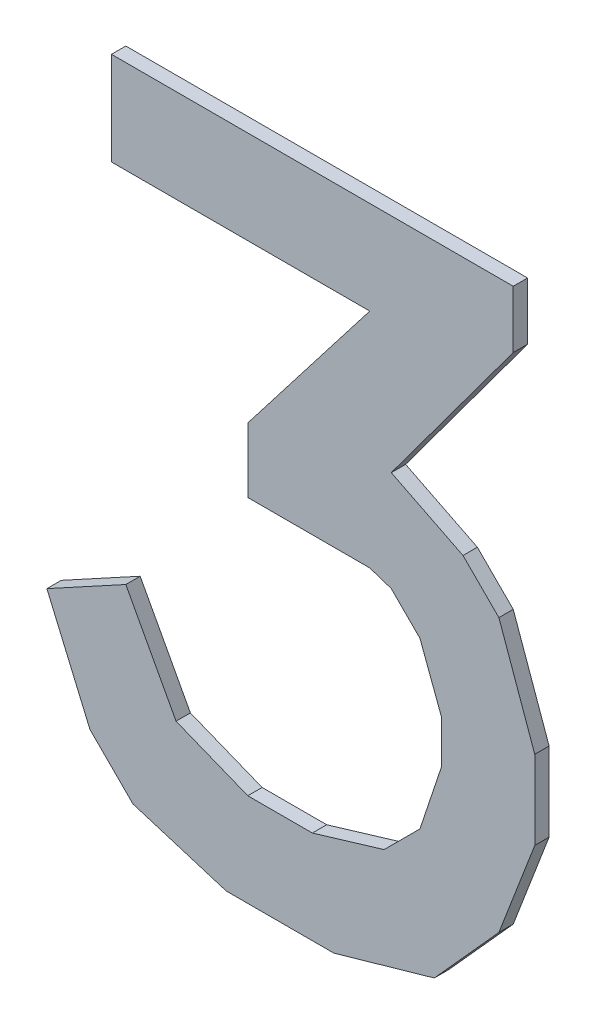
ISO-10303-21;
HEADER;
FILE_DESCRIPTION(('STEP AP214'),'2;1');
FILE_NAME('part.step','',(''),(''),'','','');
FILE_SCHEMA(('AUTOMOTIVE_DESIGN { 1 0 10303 214 1 1 1 1 }'));
ENDSEC;
DATA;
#1=APPLICATION_CONTEXT('core data for automotive mechanical design processes');
#2=APPLICATION_PROTOCOL_DEFINITION('international standard','automotive_design',2000,#1);
#3=PRODUCT_CONTEXT('',#1,'mechanical');
#4=PRODUCT('Part','Part','',(#3));
#5=PRODUCT_RELATED_PRODUCT_CATEGORY('part','',(#4));
#6=PRODUCT_DEFINITION_FORMATION('','',#4);
#7=PRODUCT_DEFINITION_CONTEXT('part definition',#1,'design');
#8=PRODUCT_DEFINITION('design','',#6,#7);
#9=PRODUCT_DEFINITION_SHAPE('','',#8);
#10=(LENGTH_UNIT() NAMED_UNIT(*) SI_UNIT(.MILLI.,.METRE.));
#11=(NAMED_UNIT(*) PLANE_ANGLE_UNIT() SI_UNIT($,.RADIAN.));
#12=(NAMED_UNIT(*) SI_UNIT($,.STERADIAN.) SOLID_ANGLE_UNIT());
#13=UNCERTAINTY_MEASURE_WITH_UNIT(LENGTH_MEASURE(1.E-05),#10,'distance_accuracy_value','');
#14=(GEOMETRIC_REPRESENTATION_CONTEXT(3) GLOBAL_UNCERTAINTY_ASSIGNED_CONTEXT((#13)) GLOBAL_UNIT_ASSIGNED_CONTEXT((#10,
#11,#12)) REPRESENTATION_CONTEXT('',''));
#15=CARTESIAN_POINT('',(0.,0.,0.));
#16=DIRECTION('',(0.,0.,1.));
#17=DIRECTION('',(1.,0.,0.));
#18=AXIS2_PLACEMENT_3D('',#15,#16,#17);
#19=CARTESIAN_POINT('',(-0.2499995,0.46500034,0.));
#20=DIRECTION('',(0.,0.,1.));
#21=DIRECTION('',(1.,0.,0.));
#22=AXIS2_PLACEMENT_3D('',#19,#20,#21);
#23=PLANE('',#22);
#24=DIRECTION('',(0.,1.,0.));
#25=VECTOR('',#24,1.);
#26=CARTESIAN_POINT('',(0.31000192,0.46500034,0.));
#27=LINE('',#26,#25);
#28=CARTESIAN_POINT('',(0.31000192,0.3850005,0.));
#29=VERTEX_POINT('',#28);
#30=CARTESIAN_POINT('',(0.31000192,0.46500034,0.));
#31=VERTEX_POINT('',#30);
#32=EDGE_CURVE('E42',#29,#31,#27,.T.);
#33=ORIENTED_EDGE('',*,*,#32,.F.);
#34=DIRECTION('',(0.594396804322224,0.804171896432304,0.));
#35=VECTOR('',#34,1.);
#36=CARTESIAN_POINT('',(0.13999972,0.15500096,0.));
#37=LINE('',#36,#35);
#38=CARTESIAN_POINT('',(0.13999972,0.15500096,0.));
#39=VERTEX_POINT('',#38);
#40=EDGE_CURVE('E308',#39,#29,#37,.T.);
#41=ORIENTED_EDGE('',*,*,#40,.F.);
#42=DIRECTION('',(-0.894427190999916,0.447213595499958,0.));
#43=VECTOR('',#42,1.);
#44=CARTESIAN_POINT('',(0.23999952,0.10500106,0.));
#45=LINE('',#44,#43);
#46=CARTESIAN_POINT('',(0.23999952,0.10500106,0.));
#47=VERTEX_POINT('',#46);
#48=EDGE_CURVE('E624',#47,#39,#45,.T.);
#49=ORIENTED_EDGE('',*,*,#48,.F.);
#50=DIRECTION('',(-0.707106781186548,0.707106781186548,0.));
#51=VECTOR('',#50,1.);
#52=CARTESIAN_POINT('',(0.28999942,0.05500116,0.));
#53=LINE('',#52,#51);
#54=CARTESIAN_POINT('',(0.28999942,0.05500116000001,0.));
#55=VERTEX_POINT('',#54);
#56=EDGE_CURVE('E361',#55,#47,#53,.T.);
#57=ORIENTED_EDGE('',*,*,#56,.F.);
#58=DIRECTION('',(-0.336351549994047,0.941736499673132,0.));
#59=VECTOR('',#58,1.);
#60=CARTESIAN_POINT('',(0.34000186,-0.08499856,0.));
#61=LINE('',#60,#59);
#62=CARTESIAN_POINT('',(0.34000186,-0.08499856,0.));
#63=VERTEX_POINT('',#62);
#64=EDGE_CURVE('E362',#63,#55,#61,.T.);
#65=ORIENTED_EDGE('',*,*,#64,.F.);
#66=DIRECTION('',(0.,1.,0.));
#67=VECTOR('',#66,1.);
#68=CARTESIAN_POINT('',(0.34000186,0.46500034,0.));
#69=LINE('',#68,#67);
#70=CARTESIAN_POINT('',(0.34000186,-0.19499834,0.));
#71=VERTEX_POINT('',#70);
#72=EDGE_CURVE('E417',#71,#63,#69,.T.);
#73=ORIENTED_EDGE('',*,*,#72,.F.);
#74=DIRECTION('',(0.358994965303913,0.933339496049772,0.));
#75=VECTOR('',#74,1.);
#76=CARTESIAN_POINT('',(0.28999942,-0.32499808,0.));
#77=LINE('',#76,#75);
#78=CARTESIAN_POINT('',(0.28999942,-0.32499808,0.));
#79=VERTEX_POINT('',#78);
#80=EDGE_CURVE('E312',#79,#71,#77,.T.);
#81=ORIENTED_EDGE('',*,*,#80,.F.);
#82=DIRECTION('',(0.668964731622284,0.743294146247316,0.));
#83=VECTOR('',#82,1.);
#84=CARTESIAN_POINT('',(0.1999996,-0.42499788,0.));
#85=LINE('',#84,#83);
#86=CARTESIAN_POINT('',(0.1999996,-0.42499788,0.));
#87=VERTEX_POINT('',#86);
#88=EDGE_CURVE('E367',#87,#79,#85,.T.);
#89=ORIENTED_EDGE('',*,*,#88,.F.);
#90=DIRECTION('',(0.961523947640936,0.274721127896982,0.));
#91=VECTOR('',#90,1.);
#92=CARTESIAN_POINT('',(0.05999987999999,-0.4649978,0.));
#93=LINE('',#92,#91);
#94=CARTESIAN_POINT('',(0.05999987999999,-0.4649978,0.));
#95=VERTEX_POINT('',#94);
#96=EDGE_CURVE('E368',#95,#87,#93,.T.);
#97=ORIENTED_EDGE('',*,*,#96,.F.);
#98=DIRECTION('',(1.,0.,0.));
#99=VECTOR('',#98,1.);
#100=CARTESIAN_POINT('',(-0.2499995,-0.4649978,0.));
#101=LINE('',#100,#99);
#102=CARTESIAN_POINT('',(-0.08999982,-0.4649978,0.));
#103=VERTEX_POINT('',#102);
#104=EDGE_CURVE('E444',#103,#95,#101,.T.);
#105=ORIENTED_EDGE('',*,*,#104,.F.);
#106=DIRECTION('',(0.95577900872182,-0.294085848837945,0.));
#107=VECTOR('',#106,1.);
#108=CARTESIAN_POINT('',(-0.21999956,-0.42499788,0.));
#109=LINE('',#108,#107);
#110=CARTESIAN_POINT('',(-0.21999956,-0.42499788,0.));
#111=VERTEX_POINT('',#110);
#112=EDGE_CURVE('E369',#111,#103,#109,.T.);
#113=ORIENTED_EDGE('',*,*,#112,.F.);
#114=DIRECTION('',(0.707106781186548,-0.707106781186548,0.));
#115=VECTOR('',#114,1.);
#116=CARTESIAN_POINT('',(-0.27999944,-0.364998,0.));
#117=LINE('',#116,#115);
#118=CARTESIAN_POINT('',(-0.27999944,-0.364998,0.));
#119=VERTEX_POINT('',#118);
#120=EDGE_CURVE('E318',#119,#111,#117,.T.);
#121=ORIENTED_EDGE('',*,*,#120,.F.);
#122=DIRECTION('',(0.393919298579047,-0.91914503001811,0.));
#123=VECTOR('',#122,1.);
#124=CARTESIAN_POINT('',(-0.33999932,-0.22499828,0.));
#125=LINE('',#124,#123);
#126=CARTESIAN_POINT('',(-0.33999932,-0.22499828,0.));
#127=VERTEX_POINT('',#126);
#128=EDGE_CURVE('E387',#127,#119,#125,.T.);
#129=ORIENTED_EDGE('',*,*,#128,.F.);
#130=DIRECTION('',(-0.877895572914117,-0.478852130681064,0.));
#131=VECTOR('',#130,1.);
#132=CARTESIAN_POINT('',(-0.22999954,-0.1649984,0.));
#133=LINE('',#132,#131);
#134=CARTESIAN_POINT('',(-0.22999954,-0.1649984,0.));
#135=VERTEX_POINT('',#134);
#136=EDGE_CURVE('E592',#135,#127,#133,.T.);
#137=ORIENTED_EDGE('',*,*,#136,.F.);
#138=DIRECTION('',(-0.474099823035077,0.880471099922143,0.));
#139=VECTOR('',#138,1.);
#140=CARTESIAN_POINT('',(-0.15999968,-0.29499814,0.));
#141=LINE('',#140,#139);
#142=CARTESIAN_POINT('',(-0.15999968,-0.29499814,0.));
#143=VERTEX_POINT('',#142);
#144=EDGE_CURVE('E482',#143,#135,#141,.T.);
#145=ORIENTED_EDGE('',*,*,#144,.F.);
#146=DIRECTION('',(-0.928476690885259,0.371390676354104,0.));
#147=VECTOR('',#146,1.);
#148=CARTESIAN_POINT('',(-0.05999988000001,-0.33499806,0.));
#149=LINE('',#148,#147);
#150=CARTESIAN_POINT('',(-0.05999988000001,-0.33499806,0.));
#151=VERTEX_POINT('',#150);
#152=EDGE_CURVE('E425',#151,#143,#149,.T.);
#153=ORIENTED_EDGE('',*,*,#152,.F.);
#154=DIRECTION('',(-1.,0.,0.));
#155=VECTOR('',#154,1.);
#156=CARTESIAN_POINT('',(-0.2499995,-0.33499806,0.));
#157=LINE('',#156,#155);
#158=CARTESIAN_POINT('',(0.02999994,-0.33499806,0.));
#159=VERTEX_POINT('',#158);
#160=EDGE_CURVE('E405',#159,#151,#157,.T.);
#161=ORIENTED_EDGE('',*,*,#160,.F.);
#162=DIRECTION('',(-0.957826285221234,-0.28734788556607,0.));
#163=VECTOR('',#162,1.);
#164=CARTESIAN_POINT('',(0.12999974,-0.30499812,0.));
#165=LINE('',#164,#163);
#166=CARTESIAN_POINT('',(0.12999974,-0.30499812,0.));
#167=VERTEX_POINT('',#166);
#168=EDGE_CURVE('E406',#167,#159,#165,.T.);
#169=ORIENTED_EDGE('',*,*,#168,.F.);
#170=DIRECTION('',(-0.707106781186548,-0.707106781186548,0.));
#171=VECTOR('',#170,1.);
#172=CARTESIAN_POINT('',(0.17999964,-0.25499822,0.));
#173=LINE('',#172,#171);
#174=CARTESIAN_POINT('',(0.17999964,-0.25499822,0.));
#175=VERTEX_POINT('',#174);
#176=EDGE_CURVE('E492',#175,#167,#173,.T.);
#177=ORIENTED_EDGE('',*,*,#176,.F.);
#178=DIRECTION('',(-0.316227766016838,-0.948683298050514,0.));
#179=VECTOR('',#178,1.);
#180=CARTESIAN_POINT('',(0.20999958,-0.1649984,0.));
#181=LINE('',#180,#179);
#182=CARTESIAN_POINT('',(0.20999958,-0.1649984,0.));
#183=VERTEX_POINT('',#182);
#184=EDGE_CURVE('E392',#183,#175,#181,.T.);
#185=ORIENTED_EDGE('',*,*,#184,.F.);
#186=DIRECTION('',(0.,-1.,0.));
#187=VECTOR('',#186,1.);
#188=CARTESIAN_POINT('',(0.20999958,0.46500034,0.));
#189=LINE('',#188,#187);
#190=CARTESIAN_POINT('',(0.20999958,-0.10499852,0.));
#191=VERTEX_POINT('',#190);
#192=EDGE_CURVE('E570',#191,#183,#189,.T.);
#193=ORIENTED_EDGE('',*,*,#192,.F.);
#194=DIRECTION('',(0.351123441588063,-0.936329177569168,0.));
#195=VECTOR('',#194,1.);
#196=CARTESIAN_POINT('',(0.17999964,-0.02499868,0.));
#197=LINE('',#196,#195);
#198=CARTESIAN_POINT('',(0.17999964,-0.02499868,0.));
#199=VERTEX_POINT('',#198);
#200=EDGE_CURVE('E556',#199,#191,#197,.T.);
#201=ORIENTED_EDGE('',*,*,#200,.F.);
#202=DIRECTION('',(0.707106781186548,-0.707106781186548,0.));
#203=VECTOR('',#202,1.);
#204=CARTESIAN_POINT('',(0.13999972,0.01500124,0.));
#205=LINE('',#204,#203);
#206=CARTESIAN_POINT('',(0.13999972,0.01500124,0.));
#207=VERTEX_POINT('',#206);
#208=EDGE_CURVE('E529',#207,#199,#205,.T.);
#209=ORIENTED_EDGE('',*,*,#208,.F.);
#210=DIRECTION('',(0.948683298050514,-0.316227766016838,0.));
#211=VECTOR('',#210,1.);
#212=CARTESIAN_POINT('',(0.10999978,0.02500121999999,0.));
#213=LINE('',#212,#211);
#214=CARTESIAN_POINT('',(0.10999978,0.02500121999999,0.));
#215=VERTEX_POINT('',#214);
#216=EDGE_CURVE('E530',#215,#207,#213,.T.);
#217=ORIENTED_EDGE('',*,*,#216,.F.);
#218=DIRECTION('',(1.,0.,0.));
#219=VECTOR('',#218,1.);
#220=CARTESIAN_POINT('',(-0.2499995,0.02500121999999,0.));
#221=LINE('',#220,#219);
#222=CARTESIAN_POINT('',(-0.05999988000001,0.02500121999999,0.));
#223=VERTEX_POINT('',#222);
#224=EDGE_CURVE('E538',#223,#215,#221,.T.);
#225=ORIENTED_EDGE('',*,*,#224,.F.);
#226=DIRECTION('',(0.,-1.,0.));
#227=VECTOR('',#226,1.);
#228=CARTESIAN_POINT('',(-0.05999988000001,0.46500034,0.));
#229=LINE('',#228,#227);
#230=CARTESIAN_POINT('',(-0.05999988000001,0.11500104,0.));
#231=VERTEX_POINT('',#230);
#232=EDGE_CURVE('E524',#231,#223,#229,.T.);
#233=ORIENTED_EDGE('',*,*,#232,.F.);
#234=DIRECTION('',(-0.611447501075993,-0.791285001391991,0.));
#235=VECTOR('',#234,1.);
#236=CARTESIAN_POINT('',(0.10999978,0.3350006,0.));
#237=LINE('',#236,#235);
#238=CARTESIAN_POINT('',(0.10999978,0.3350006,0.));
#239=VERTEX_POINT('',#238);
#240=EDGE_CURVE('E469',#239,#231,#237,.T.);
#241=ORIENTED_EDGE('',*,*,#240,.F.);
#242=DIRECTION('',(1.,0.,0.));
#243=VECTOR('',#242,1.);
#244=CARTESIAN_POINT('',(-0.2499995,0.3350006,0.));
#245=LINE('',#244,#243);
#246=CARTESIAN_POINT('',(-0.2499995,0.3350006,0.));
#247=VERTEX_POINT('',#246);
#248=EDGE_CURVE('E470',#247,#239,#245,.T.);
#249=ORIENTED_EDGE('',*,*,#248,.F.);
#250=DIRECTION('',(0.,-1.,0.));
#251=VECTOR('',#250,1.);
#252=CARTESIAN_POINT('',(-0.2499995,0.46500034,0.));
#253=LINE('',#252,#251);
#254=CARTESIAN_POINT('',(-0.2499995,0.46500034,0.));
#255=VERTEX_POINT('',#254);
#256=EDGE_CURVE('E374',#255,#247,#253,.T.);
#257=ORIENTED_EDGE('',*,*,#256,.F.);
#258=DIRECTION('',(-1.,0.,0.));
#259=VECTOR('',#258,1.);
#260=CARTESIAN_POINT('',(-0.2499995,0.46500034,0.));
#261=LINE('',#260,#259);
#262=EDGE_CURVE('E11',#31,#255,#261,.T.);
#263=ORIENTED_EDGE('',*,*,#262,.F.);
#264=EDGE_LOOP('',(#33,#41,#49,#57,#65,#73,#81,#89,#97,#105,#113,#121,#129,#137,#145,#153,#161,
#169,#177,#185,#193,#201,#209,#217,#225,#233,#241,#249,#257,#263));
#265=FACE_BOUND('',#264,.T.);
#266=ADVANCED_FACE('F17',(#265),#23,.F.);
#267=CARTESIAN_POINT('',(-0.2499995,0.46500034,0.));
#268=DIRECTION('',(0.,1.,0.));
#269=DIRECTION('',(1.,0.,0.));
#270=AXIS2_PLACEMENT_3D('',#267,#268,#269);
#271=PLANE('',#270);
#272=DIRECTION('',(0.,0.,-1.));
#273=VECTOR('',#272,1.);
#274=CARTESIAN_POINT('',(0.31000192,0.46500034,0.));
#275=LINE('',#274,#273);
#276=CARTESIAN_POINT('',(0.31000192,0.46500034,0.02));
#277=VERTEX_POINT('',#276);
#278=EDGE_CURVE('E25',#277,#31,#275,.T.);
#279=ORIENTED_EDGE('',*,*,#278,.T.);
#280=ORIENTED_EDGE('',*,*,#262,.T.);
#281=DIRECTION('',(0.,0.,1.));
#282=VECTOR('',#281,1.);
#283=CARTESIAN_POINT('',(-0.2499995,0.46500034,0.));
#284=LINE('',#283,#282);
#285=CARTESIAN_POINT('',(-0.2499995,0.46500034,0.02));
#286=VERTEX_POINT('',#285);
#287=EDGE_CURVE('E286',#255,#286,#284,.T.);
#288=ORIENTED_EDGE('',*,*,#287,.T.);
#289=DIRECTION('',(1.,0.,0.));
#290=VECTOR('',#289,1.);
#291=CARTESIAN_POINT('',(-0.2499995,0.46500034,0.02));
#292=LINE('',#291,#290);
#293=EDGE_CURVE('E283',#286,#277,#292,.T.);
#294=ORIENTED_EDGE('',*,*,#293,.T.);
#295=EDGE_LOOP('',(#279,#280,#288,#294));
#296=FACE_BOUND('',#295,.T.);
#297=ADVANCED_FACE('F284',(#296),#271,.T.);
#298=CARTESIAN_POINT('',(0.31000192,0.46500034,0.));
#299=DIRECTION('',(1.,0.,0.));
#300=DIRECTION('',(0.,1.,0.));
#301=AXIS2_PLACEMENT_3D('',#298,#299,#300);
#302=PLANE('',#301);
#303=DIRECTION('',(0.,0.,-1.));
#304=VECTOR('',#303,1.);
#305=CARTESIAN_POINT('',(0.31000192,0.3850005,0.));
#306=LINE('',#305,#304);
#307=CARTESIAN_POINT('',(0.31000192,0.3850005,0.02));
#308=VERTEX_POINT('',#307);
#309=EDGE_CURVE('E305',#308,#29,#306,.T.);
#310=ORIENTED_EDGE('',*,*,#309,.T.);
#311=ORIENTED_EDGE('',*,*,#32,.T.);
#312=ORIENTED_EDGE('',*,*,#278,.F.);
#313=DIRECTION('',(0.,-1.,0.));
#314=VECTOR('',#313,1.);
#315=CARTESIAN_POINT('',(0.31000192,0.46500034,0.02));
#316=LINE('',#315,#314);
#317=EDGE_CURVE('E279',#277,#308,#316,.T.);
#318=ORIENTED_EDGE('',*,*,#317,.T.);
#319=EDGE_LOOP('',(#310,#311,#312,#318));
#320=FACE_BOUND('',#319,.T.);
#321=ADVANCED_FACE('F277',(#320),#302,.T.);
#322=CARTESIAN_POINT('',(0.31000192,0.3850005,0.));
#323=DIRECTION('',(0.804171896432304,-0.594396804322224,0.));
#324=DIRECTION('',(0.,0.,-1.));
#325=AXIS2_PLACEMENT_3D('',#322,#323,#324);
#326=PLANE('',#325);
#327=DIRECTION('',(0.,0.,-1.));
#328=VECTOR('',#327,1.);
#329=CARTESIAN_POINT('',(0.13999972,0.15500096,0.));
#330=LINE('',#329,#328);
#331=CARTESIAN_POINT('',(0.13999972,0.15500096,0.02));
#332=VERTEX_POINT('',#331);
#333=EDGE_CURVE('E628',#332,#39,#330,.T.);
#334=ORIENTED_EDGE('',*,*,#333,.T.);
#335=ORIENTED_EDGE('',*,*,#40,.T.);
#336=ORIENTED_EDGE('',*,*,#309,.F.);
#337=DIRECTION('',(-0.594396804322224,-0.804171896432304,0.));
#338=VECTOR('',#337,1.);
#339=CARTESIAN_POINT('',(0.31000192,0.3850005,0.02));
#340=LINE('',#339,#338);
#341=EDGE_CURVE('E297',#308,#332,#340,.T.);
#342=ORIENTED_EDGE('',*,*,#341,.T.);
#343=EDGE_LOOP('',(#334,#335,#336,#342));
#344=FACE_BOUND('',#343,.T.);
#345=ADVANCED_FACE('F943',(#344),#326,.T.);
#346=CARTESIAN_POINT('',(0.13999972,0.15500096,0.));
#347=DIRECTION('',(0.447213595499958,0.894427190999916,0.));
#348=DIRECTION('',(0.,0.,-1.));
#349=AXIS2_PLACEMENT_3D('',#346,#347,#348);
#350=PLANE('',#349);
#351=DIRECTION('',(0.,0.,-1.));
#352=VECTOR('',#351,1.);
#353=CARTESIAN_POINT('',(0.23999952,0.10500106,0.));
#354=LINE('',#353,#352);
#355=CARTESIAN_POINT('',(0.23999952,0.10500106,0.02));
#356=VERTEX_POINT('',#355);
#357=EDGE_CURVE('E620',#356,#47,#354,.T.);
#358=ORIENTED_EDGE('',*,*,#357,.T.);
#359=ORIENTED_EDGE('',*,*,#48,.T.);
#360=ORIENTED_EDGE('',*,*,#333,.F.);
#361=DIRECTION('',(0.894427190999916,-0.447213595499958,0.));
#362=VECTOR('',#361,1.);
#363=CARTESIAN_POINT('',(0.13999972,0.15500096,0.02));
#364=LINE('',#363,#362);
#365=EDGE_CURVE('E338',#332,#356,#364,.T.);
#366=ORIENTED_EDGE('',*,*,#365,.T.);
#367=EDGE_LOOP('',(#358,#359,#360,#366));
#368=FACE_BOUND('',#367,.T.);
#369=ADVANCED_FACE('F941',(#368),#350,.T.);
#370=CARTESIAN_POINT('',(0.23999952,0.10500106,0.));
#371=DIRECTION('',(0.707106781186048,0.707106781187048,0.));
#372=DIRECTION('',(0.,0.,-1.));
#373=AXIS2_PLACEMENT_3D('',#370,#371,#372);
#374=PLANE('',#373);
#375=DIRECTION('',(0.,0.,-1.));
#376=VECTOR('',#375,1.);
#377=CARTESIAN_POINT('',(0.28999942,0.05500116000004,0.));
#378=LINE('',#377,#376);
#379=CARTESIAN_POINT('',(0.28999942,0.05500116000001,0.02));
#380=VERTEX_POINT('',#379);
#381=EDGE_CURVE('E357',#380,#55,#378,.T.);
#382=ORIENTED_EDGE('',*,*,#381,.T.);
#383=ORIENTED_EDGE('',*,*,#56,.T.);
#384=ORIENTED_EDGE('',*,*,#357,.F.);
#385=DIRECTION('',(0.707106781187048,-0.707106781186048,0.));
#386=VECTOR('',#385,1.);
#387=CARTESIAN_POINT('',(0.23999952,0.10500106,0.02));
#388=LINE('',#387,#386);
#389=EDGE_CURVE('E342',#356,#380,#388,.T.);
#390=ORIENTED_EDGE('',*,*,#389,.T.);
#391=EDGE_LOOP('',(#382,#383,#384,#390));
#392=FACE_BOUND('',#391,.T.);
#393=ADVANCED_FACE('F939',(#392),#374,.T.);
#394=CARTESIAN_POINT('',(0.28999942,0.05500116,0.));
#395=DIRECTION('',(0.941736499673132,0.336351549994047,0.));
#396=DIRECTION('',(0.,0.,-1.));
#397=AXIS2_PLACEMENT_3D('',#394,#395,#396);
#398=PLANE('',#397);
#399=DIRECTION('',(0.,0.,-1.));
#400=VECTOR('',#399,1.);
#401=CARTESIAN_POINT('',(0.34000186,-0.08499855999999,0.));
#402=LINE('',#401,#400);
#403=CARTESIAN_POINT('',(0.34000186,-0.08499856,0.02));
#404=VERTEX_POINT('',#403);
#405=EDGE_CURVE('E413',#404,#63,#402,.T.);
#406=ORIENTED_EDGE('',*,*,#405,.T.);
#407=ORIENTED_EDGE('',*,*,#64,.T.);
#408=ORIENTED_EDGE('',*,*,#381,.F.);
#409=DIRECTION('',(0.336351549994047,-0.941736499673132,0.));
#410=VECTOR('',#409,1.);
#411=CARTESIAN_POINT('',(0.28999942,0.05500116,0.02));
#412=LINE('',#411,#410);
#413=EDGE_CURVE('E491',#380,#404,#412,.T.);
#414=ORIENTED_EDGE('',*,*,#413,.T.);
#415=EDGE_LOOP('',(#406,#407,#408,#414));
#416=FACE_BOUND('',#415,.T.);
#417=ADVANCED_FACE('F937',(#416),#398,.T.);
#418=CARTESIAN_POINT('',(0.34000186,-0.08499856,0.));
#419=DIRECTION('',(1.,0.,0.));
#420=DIRECTION('',(0.,1.,0.));
#421=AXIS2_PLACEMENT_3D('',#418,#419,#420);
#422=PLANE('',#421);
#423=DIRECTION('',(0.,0.,-1.));
#424=VECTOR('',#423,1.);
#425=CARTESIAN_POINT('',(0.34000186,-0.19499834,0.));
#426=LINE('',#425,#424);
#427=CARTESIAN_POINT('',(0.34000186,-0.19499834,0.02));
#428=VERTEX_POINT('',#427);
#429=EDGE_CURVE('E316',#428,#71,#426,.T.);
#430=ORIENTED_EDGE('',*,*,#429,.T.);
#431=ORIENTED_EDGE('',*,*,#72,.T.);
#432=ORIENTED_EDGE('',*,*,#405,.F.);
#433=DIRECTION('',(0.,-1.,0.));
#434=VECTOR('',#433,1.);
#435=CARTESIAN_POINT('',(0.34000186,-0.08499856,0.02));
#436=LINE('',#435,#434);
#437=EDGE_CURVE('E481',#404,#428,#436,.T.);
#438=ORIENTED_EDGE('',*,*,#437,.T.);
#439=EDGE_LOOP('',(#430,#431,#432,#438));
#440=FACE_BOUND('',#439,.T.);
#441=ADVANCED_FACE('F933',(#440),#422,.T.);
#442=CARTESIAN_POINT('',(0.34000186,-0.19499834,0.));
#443=DIRECTION('',(0.933339496049772,-0.358994965303913,0.));
#444=DIRECTION('',(0.,0.,-1.));
#445=AXIS2_PLACEMENT_3D('',#442,#443,#444);
#446=PLANE('',#445);
#447=DIRECTION('',(0.,0.,-1.));
#448=VECTOR('',#447,1.);
#449=CARTESIAN_POINT('',(0.28999942,-0.32499808,0.));
#450=LINE('',#449,#448);
#451=CARTESIAN_POINT('',(0.28999942,-0.32499808,0.02));
#452=VERTEX_POINT('',#451);
#453=EDGE_CURVE('E317',#452,#79,#450,.T.);
#454=ORIENTED_EDGE('',*,*,#453,.T.);
#455=ORIENTED_EDGE('',*,*,#80,.T.);
#456=ORIENTED_EDGE('',*,*,#429,.F.);
#457=DIRECTION('',(-0.358994965303913,-0.933339496049772,0.));
#458=VECTOR('',#457,1.);
#459=CARTESIAN_POINT('',(0.34000186,-0.19499834,0.02));
#460=LINE('',#459,#458);
#461=EDGE_CURVE('E474',#428,#452,#460,.T.);
#462=ORIENTED_EDGE('',*,*,#461,.T.);
#463=EDGE_LOOP('',(#454,#455,#456,#462));
#464=FACE_BOUND('',#463,.T.);
#465=ADVANCED_FACE('F931',(#464),#446,.T.);
#466=CARTESIAN_POINT('',(0.28999942,-0.32499808,0.));
#467=DIRECTION('',(0.743294146247316,-0.668964731622284,0.));
#468=DIRECTION('',(0.,0.,-1.));
#469=AXIS2_PLACEMENT_3D('',#466,#467,#468);
#470=PLANE('',#469);
#471=DIRECTION('',(0.,0.,-1.));
#472=VECTOR('',#471,1.);
#473=CARTESIAN_POINT('',(0.1999996,-0.42499788,0.));
#474=LINE('',#473,#472);
#475=CARTESIAN_POINT('',(0.1999996,-0.42499788,0.02));
#476=VERTEX_POINT('',#475);
#477=EDGE_CURVE('E363',#476,#87,#474,.T.);
#478=ORIENTED_EDGE('',*,*,#477,.T.);
#479=ORIENTED_EDGE('',*,*,#88,.T.);
#480=ORIENTED_EDGE('',*,*,#453,.F.);
#481=DIRECTION('',(-0.668964731622284,-0.743294146247316,0.));
#482=VECTOR('',#481,1.);
#483=CARTESIAN_POINT('',(0.28999942,-0.32499808,0.02));
#484=LINE('',#483,#482);
#485=EDGE_CURVE('E464',#452,#476,#484,.T.);
#486=ORIENTED_EDGE('',*,*,#485,.T.);
#487=EDGE_LOOP('',(#478,#479,#480,#486));
#488=FACE_BOUND('',#487,.T.);
#489=ADVANCED_FACE('F929',(#488),#470,.T.);
#490=CARTESIAN_POINT('',(0.1999996,-0.42499788,0.));
#491=DIRECTION('',(0.274721127896982,-0.961523947640936,0.));
#492=DIRECTION('',(0.,0.,-1.));
#493=AXIS2_PLACEMENT_3D('',#490,#491,#492);
#494=PLANE('',#493);
#495=DIRECTION('',(0.,0.,-1.));
#496=VECTOR('',#495,1.);
#497=CARTESIAN_POINT('',(0.05999987999997,-0.4649978,0.));
#498=LINE('',#497,#496);
#499=CARTESIAN_POINT('',(0.05999987999999,-0.4649978,0.02));
#500=VERTEX_POINT('',#499);
#501=EDGE_CURVE('E440',#500,#95,#498,.T.);
#502=ORIENTED_EDGE('',*,*,#501,.T.);
#503=ORIENTED_EDGE('',*,*,#96,.T.);
#504=ORIENTED_EDGE('',*,*,#477,.F.);
#505=DIRECTION('',(-0.961523947640936,-0.274721127896982,0.));
#506=VECTOR('',#505,1.);
#507=CARTESIAN_POINT('',(0.1999996,-0.42499788,0.02));
#508=LINE('',#507,#506);
#509=EDGE_CURVE('E460',#476,#500,#508,.T.);
#510=ORIENTED_EDGE('',*,*,#509,.T.);
#511=EDGE_LOOP('',(#502,#503,#504,#510));
#512=FACE_BOUND('',#511,.T.);
#513=ADVANCED_FACE('F924',(#512),#494,.T.);
#514=CARTESIAN_POINT('',(0.05999987999999,-0.4649978,0.));
#515=DIRECTION('',(0.,-1.,0.));
#516=DIRECTION('',(0.,0.,-1.));
#517=AXIS2_PLACEMENT_3D('',#514,#515,#516);
#518=PLANE('',#517);
#519=DIRECTION('',(0.,0.,-1.));
#520=VECTOR('',#519,1.);
#521=CARTESIAN_POINT('',(-0.08999982,-0.4649978,0.));
#522=LINE('',#521,#520);
#523=CARTESIAN_POINT('',(-0.08999982,-0.4649978,0.02));
#524=VERTEX_POINT('',#523);
#525=EDGE_CURVE('E373',#524,#103,#522,.T.);
#526=ORIENTED_EDGE('',*,*,#525,.T.);
#527=ORIENTED_EDGE('',*,*,#104,.T.);
#528=ORIENTED_EDGE('',*,*,#501,.F.);
#529=DIRECTION('',(-1.,0.,0.));
#530=VECTOR('',#529,1.);
#531=CARTESIAN_POINT('',(0.05999987999999,-0.4649978,0.02));
#532=LINE('',#531,#530);
#533=EDGE_CURVE('E456',#500,#524,#532,.T.);
#534=ORIENTED_EDGE('',*,*,#533,.T.);
#535=EDGE_LOOP('',(#526,#527,#528,#534));
#536=FACE_BOUND('',#535,.T.);
#537=ADVANCED_FACE('F922',(#536),#518,.T.);
#538=CARTESIAN_POINT('',(-0.08999982,-0.4649978,0.));
#539=DIRECTION('',(-0.294085848837945,-0.95577900872182,0.));
#540=DIRECTION('',(-0.95577900872182,0.294085848837945,0.));
#541=AXIS2_PLACEMENT_3D('',#538,#539,#540);
#542=PLANE('',#541);
#543=DIRECTION('',(0.,0.,-1.));
#544=VECTOR('',#543,1.);
#545=CARTESIAN_POINT('',(-0.21999956,-0.42499788,0.));
#546=LINE('',#545,#544);
#547=CARTESIAN_POINT('',(-0.21999956,-0.42499788,0.02));
#548=VERTEX_POINT('',#547);
#549=EDGE_CURVE('E322',#548,#111,#546,.T.);
#550=ORIENTED_EDGE('',*,*,#549,.T.);
#551=ORIENTED_EDGE('',*,*,#112,.T.);
#552=ORIENTED_EDGE('',*,*,#525,.F.);
#553=DIRECTION('',(-0.95577900872182,0.294085848837945,0.));
#554=VECTOR('',#553,1.);
#555=CARTESIAN_POINT('',(-0.08999982,-0.4649978,0.02));
#556=LINE('',#555,#554);
#557=EDGE_CURVE('E452',#524,#548,#556,.T.);
#558=ORIENTED_EDGE('',*,*,#557,.T.);
#559=EDGE_LOOP('',(#550,#551,#552,#558));
#560=FACE_BOUND('',#559,.T.);
#561=ADVANCED_FACE('F920',(#560),#542,.T.);
#562=CARTESIAN_POINT('',(-0.21999956,-0.42499788,0.));
#563=DIRECTION('',(-0.707106781187048,-0.707106781186048,0.));
#564=DIRECTION('',(-0.707106781186048,0.707106781187048,0.));
#565=AXIS2_PLACEMENT_3D('',#562,#563,#564);
#566=PLANE('',#565);
#567=DIRECTION('',(0.,0.,-1.));
#568=VECTOR('',#567,1.);
#569=CARTESIAN_POINT('',(-0.27999944,-0.364998,0.));
#570=LINE('',#569,#568);
#571=CARTESIAN_POINT('',(-0.27999944,-0.364998,0.02));
#572=VERTEX_POINT('',#571);
#573=EDGE_CURVE('E323',#572,#119,#570,.T.);
#574=ORIENTED_EDGE('',*,*,#573,.T.);
#575=ORIENTED_EDGE('',*,*,#120,.T.);
#576=ORIENTED_EDGE('',*,*,#549,.F.);
#577=DIRECTION('',(-0.707106781186048,0.707106781187048,0.));
#578=VECTOR('',#577,1.);
#579=CARTESIAN_POINT('',(-0.21999956,-0.42499788,0.02));
#580=LINE('',#579,#578);
#581=EDGE_CURVE('E448',#548,#572,#580,.T.);
#582=ORIENTED_EDGE('',*,*,#581,.T.);
#583=EDGE_LOOP('',(#574,#575,#576,#582));
#584=FACE_BOUND('',#583,.T.);
#585=ADVANCED_FACE('F915',(#584),#566,.T.);
#586=CARTESIAN_POINT('',(-0.27999944,-0.364998,0.));
#587=DIRECTION('',(-0.91914503001811,-0.393919298579047,0.));
#588=DIRECTION('',(-0.393919298579047,0.91914503001811,0.));
#589=AXIS2_PLACEMENT_3D('',#586,#587,#588);
#590=PLANE('',#589);
#591=DIRECTION('',(0.,0.,-1.));
#592=VECTOR('',#591,1.);
#593=CARTESIAN_POINT('',(-0.33999932,-0.22499828,0.));
#594=LINE('',#593,#592);
#595=CARTESIAN_POINT('',(-0.33999932,-0.22499828,0.02));
#596=VERTEX_POINT('',#595);
#597=EDGE_CURVE('E391',#596,#127,#594,.T.);
#598=ORIENTED_EDGE('',*,*,#597,.T.);
#599=ORIENTED_EDGE('',*,*,#128,.T.);
#600=ORIENTED_EDGE('',*,*,#573,.F.);
#601=DIRECTION('',(-0.393919298579047,0.91914503001811,0.));
#602=VECTOR('',#601,1.);
#603=CARTESIAN_POINT('',(-0.27999944,-0.364998,0.02));
#604=LINE('',#603,#602);
#605=EDGE_CURVE('E439',#572,#596,#604,.T.);
#606=ORIENTED_EDGE('',*,*,#605,.T.);
#607=EDGE_LOOP('',(#598,#599,#600,#606));
#608=FACE_BOUND('',#607,.T.);
#609=ADVANCED_FACE('F908',(#608),#590,.T.);
#610=CARTESIAN_POINT('',(-0.33999932,-0.22499828,0.));
#611=DIRECTION('',(-0.478852130681064,0.877895572914117,0.));
#612=DIRECTION('',(0.,0.,1.));
#613=AXIS2_PLACEMENT_3D('',#610,#611,#612);
#614=PLANE('',#613);
#615=DIRECTION('',(0.,0.,-1.));
#616=VECTOR('',#615,1.);
#617=CARTESIAN_POINT('',(-0.22999954,-0.1649984,0.));
#618=LINE('',#617,#616);
#619=CARTESIAN_POINT('',(-0.22999954,-0.1649984,0.02));
#620=VERTEX_POINT('',#619);
#621=EDGE_CURVE('E486',#620,#135,#618,.T.);
#622=ORIENTED_EDGE('',*,*,#621,.T.);
#623=ORIENTED_EDGE('',*,*,#136,.T.);
#624=ORIENTED_EDGE('',*,*,#597,.F.);
#625=DIRECTION('',(0.877895572914117,0.478852130681064,0.));
#626=VECTOR('',#625,1.);
#627=CARTESIAN_POINT('',(-0.33999932,-0.22499828,0.02));
#628=LINE('',#627,#626);
#629=EDGE_CURVE('E435',#596,#620,#628,.T.);
#630=ORIENTED_EDGE('',*,*,#629,.T.);
#631=EDGE_LOOP('',(#622,#623,#624,#630));
#632=FACE_BOUND('',#631,.T.);
#633=ADVANCED_FACE('F913',(#632),#614,.T.);
#634=CARTESIAN_POINT('',(-0.22999954,-0.1649984,0.));
#635=DIRECTION('',(0.880471099922143,0.474099823035077,0.));
#636=DIRECTION('',(0.,0.,-1.));
#637=AXIS2_PLACEMENT_3D('',#634,#635,#636);
#638=PLANE('',#637);
#639=DIRECTION('',(0.,0.,-1.));
#640=VECTOR('',#639,1.);
#641=CARTESIAN_POINT('',(-0.15999968,-0.29499814,0.));
#642=LINE('',#641,#640);
#643=CARTESIAN_POINT('',(-0.15999968,-0.29499814,0.02));
#644=VERTEX_POINT('',#643);
#645=EDGE_CURVE('E487',#644,#143,#642,.T.);
#646=ORIENTED_EDGE('',*,*,#645,.T.);
#647=ORIENTED_EDGE('',*,*,#144,.T.);
#648=ORIENTED_EDGE('',*,*,#621,.F.);
#649=DIRECTION('',(0.474099823035077,-0.880471099922143,0.));
#650=VECTOR('',#649,1.);
#651=CARTESIAN_POINT('',(-0.22999954,-0.1649984,0.02));
#652=LINE('',#651,#650);
#653=EDGE_CURVE('E411',#620,#644,#652,.T.);
#654=ORIENTED_EDGE('',*,*,#653,.T.);
#655=EDGE_LOOP('',(#646,#647,#648,#654));
#656=FACE_BOUND('',#655,.T.);
#657=ADVANCED_FACE('F1018',(#656),#638,.T.);
#658=CARTESIAN_POINT('',(-0.15999968,-0.29499814,0.));
#659=DIRECTION('',(0.371390676354104,0.928476690885259,0.));
#660=DIRECTION('',(0.,0.,-1.));
#661=AXIS2_PLACEMENT_3D('',#658,#659,#660);
#662=PLANE('',#661);
#663=DIRECTION('',(0.,0.,-1.));
#664=VECTOR('',#663,1.);
#665=CARTESIAN_POINT('',(-0.05999988000001,-0.33499806,0.));
#666=LINE('',#665,#664);
#667=CARTESIAN_POINT('',(-0.05999988000001,-0.33499806,0.02));
#668=VERTEX_POINT('',#667);
#669=EDGE_CURVE('E421',#668,#151,#666,.T.);
#670=ORIENTED_EDGE('',*,*,#669,.T.);
#671=ORIENTED_EDGE('',*,*,#152,.T.);
#672=ORIENTED_EDGE('',*,*,#645,.F.);
#673=DIRECTION('',(0.928476690885259,-0.371390676354104,0.));
#674=VECTOR('',#673,1.);
#675=CARTESIAN_POINT('',(-0.15999968,-0.29499814,0.02));
#676=LINE('',#675,#674);
#677=EDGE_CURVE('E407',#644,#668,#676,.T.);
#678=ORIENTED_EDGE('',*,*,#677,.T.);
#679=EDGE_LOOP('',(#670,#671,#672,#678));
#680=FACE_BOUND('',#679,.T.);
#681=ADVANCED_FACE('F1025',(#680),#662,.T.);
#682=CARTESIAN_POINT('',(-0.05999988000001,-0.33499806,0.));
#683=DIRECTION('',(0.,1.,0.));
#684=DIRECTION('',(1.,0.,0.));
#685=AXIS2_PLACEMENT_3D('',#682,#683,#684);
#686=PLANE('',#685);
#687=DIRECTION('',(0.,0.,-1.));
#688=VECTOR('',#687,1.);
#689=CARTESIAN_POINT('',(0.02999994,-0.33499806,0.));
#690=LINE('',#689,#688);
#691=CARTESIAN_POINT('',(0.02999994,-0.33499806,0.02));
#692=VERTEX_POINT('',#691);
#693=EDGE_CURVE('E401',#692,#159,#690,.T.);
#694=ORIENTED_EDGE('',*,*,#693,.T.);
#695=ORIENTED_EDGE('',*,*,#160,.T.);
#696=ORIENTED_EDGE('',*,*,#669,.F.);
#697=DIRECTION('',(1.,0.,0.));
#698=VECTOR('',#697,1.);
#699=CARTESIAN_POINT('',(-0.05999988000001,-0.33499806,0.02));
#700=LINE('',#699,#698);
#701=EDGE_CURVE('E412',#668,#692,#700,.T.);
#702=ORIENTED_EDGE('',*,*,#701,.T.);
#703=EDGE_LOOP('',(#694,#695,#696,#702));
#704=FACE_BOUND('',#703,.T.);
#705=ADVANCED_FACE('F1034',(#704),#686,.T.);
#706=CARTESIAN_POINT('',(0.02999994,-0.33499806,0.));
#707=DIRECTION('',(-0.28734788556607,0.957826285221234,0.));
#708=DIRECTION('',(0.,0.,1.));
#709=AXIS2_PLACEMENT_3D('',#706,#707,#708);
#710=PLANE('',#709);
#711=DIRECTION('',(0.,0.,-1.));
#712=VECTOR('',#711,1.);
#713=CARTESIAN_POINT('',(0.12999974,-0.30499812,0.));
#714=LINE('',#713,#712);
#715=CARTESIAN_POINT('',(0.12999974,-0.30499812,0.02));
#716=VERTEX_POINT('',#715);
#717=EDGE_CURVE('E496',#716,#167,#714,.T.);
#718=ORIENTED_EDGE('',*,*,#717,.T.);
#719=ORIENTED_EDGE('',*,*,#168,.T.);
#720=ORIENTED_EDGE('',*,*,#693,.F.);
#721=DIRECTION('',(0.957826285221234,0.28734788556607,0.));
#722=VECTOR('',#721,1.);
#723=CARTESIAN_POINT('',(0.02999994,-0.33499806,0.02));
#724=LINE('',#723,#722);
#725=EDGE_CURVE('E328',#692,#716,#724,.T.);
#726=ORIENTED_EDGE('',*,*,#725,.T.);
#727=EDGE_LOOP('',(#718,#719,#720,#726));
#728=FACE_BOUND('',#727,.T.);
#729=ADVANCED_FACE('F1043',(#728),#710,.T.);
#730=CARTESIAN_POINT('',(0.12999974,-0.30499812,0.));
#731=DIRECTION('',(-0.707106781187048,0.707106781186048,0.));
#732=DIRECTION('',(0.,0.,1.));
#733=AXIS2_PLACEMENT_3D('',#730,#731,#732);
#734=PLANE('',#733);
#735=DIRECTION('',(0.,0.,-1.));
#736=VECTOR('',#735,1.);
#737=CARTESIAN_POINT('',(0.17999964,-0.25499822,0.));
#738=LINE('',#737,#736);
#739=CARTESIAN_POINT('',(0.17999964,-0.25499822,0.02));
#740=VERTEX_POINT('',#739);
#741=EDGE_CURVE('E396',#740,#175,#738,.T.);
#742=ORIENTED_EDGE('',*,*,#741,.T.);
#743=ORIENTED_EDGE('',*,*,#176,.T.);
#744=ORIENTED_EDGE('',*,*,#717,.F.);
#745=DIRECTION('',(0.707106781186048,0.707106781187048,0.));
#746=VECTOR('',#745,1.);
#747=CARTESIAN_POINT('',(0.12999974,-0.30499812,0.02));
#748=LINE('',#747,#746);
#749=EDGE_CURVE('E324',#716,#740,#748,.T.);
#750=ORIENTED_EDGE('',*,*,#749,.T.);
#751=EDGE_LOOP('',(#742,#743,#744,#750));
#752=FACE_BOUND('',#751,.T.);
#753=ADVANCED_FACE('F1052',(#752),#734,.T.);
#754=CARTESIAN_POINT('',(0.17999964,-0.25499822,0.));
#755=DIRECTION('',(-0.948683298050414,0.316227766017138,0.));
#756=DIRECTION('',(0.,0.,1.));
#757=AXIS2_PLACEMENT_3D('',#754,#755,#756);
#758=PLANE('',#757);
#759=DIRECTION('',(0.,0.,-1.));
#760=VECTOR('',#759,1.);
#761=CARTESIAN_POINT('',(0.20999958,-0.1649984,0.));
#762=LINE('',#761,#760);
#763=CARTESIAN_POINT('',(0.20999958,-0.1649984,0.02));
#764=VERTEX_POINT('',#763);
#765=EDGE_CURVE('E397',#764,#183,#762,.T.);
#766=ORIENTED_EDGE('',*,*,#765,.T.);
#767=ORIENTED_EDGE('',*,*,#184,.T.);
#768=ORIENTED_EDGE('',*,*,#741,.F.);
#769=DIRECTION('',(0.316227766017138,0.948683298050414,0.));
#770=VECTOR('',#769,1.);
#771=CARTESIAN_POINT('',(0.17999964,-0.25499822,0.02));
#772=LINE('',#771,#770);
#773=EDGE_CURVE('E329',#740,#764,#772,.T.);
#774=ORIENTED_EDGE('',*,*,#773,.T.);
#775=EDGE_LOOP('',(#766,#767,#768,#774));
#776=FACE_BOUND('',#775,.T.);
#777=ADVANCED_FACE('F1061',(#776),#758,.T.);
#778=CARTESIAN_POINT('',(0.20999958,-0.1649984,0.));
#779=DIRECTION('',(-1.,0.,0.));
#780=DIRECTION('',(0.,0.,1.));
#781=AXIS2_PLACEMENT_3D('',#778,#779,#780);
#782=PLANE('',#781);
#783=DIRECTION('',(0.,0.,-1.));
#784=VECTOR('',#783,1.);
#785=CARTESIAN_POINT('',(0.20999958,-0.10499852,0.));
#786=LINE('',#785,#784);
#787=CARTESIAN_POINT('',(0.20999958,-0.10499852,0.02));
#788=VERTEX_POINT('',#787);
#789=EDGE_CURVE('E563',#788,#191,#786,.T.);
#790=ORIENTED_EDGE('',*,*,#789,.T.);
#791=ORIENTED_EDGE('',*,*,#192,.T.);
#792=ORIENTED_EDGE('',*,*,#765,.F.);
#793=DIRECTION('',(0.,1.,0.));
#794=VECTOR('',#793,1.);
#795=CARTESIAN_POINT('',(0.20999958,-0.1649984,0.02));
#796=LINE('',#795,#794);
#797=EDGE_CURVE('E337',#764,#788,#796,.T.);
#798=ORIENTED_EDGE('',*,*,#797,.T.);
#799=EDGE_LOOP('',(#790,#791,#792,#798));
#800=FACE_BOUND('',#799,.T.);
#801=ADVANCED_FACE('F1070',(#800),#782,.T.);
#802=CARTESIAN_POINT('',(0.20999958,-0.10499852,0.));
#803=DIRECTION('',(-0.936329177569168,-0.351123441588063,0.));
#804=DIRECTION('',(-0.351123441588063,0.936329177569168,0.));
#805=AXIS2_PLACEMENT_3D('',#802,#803,#804);
#806=PLANE('',#805);
#807=DIRECTION('',(0.,0.,-1.));
#808=VECTOR('',#807,1.);
#809=CARTESIAN_POINT('',(0.17999964,-0.02499867999999,0.));
#810=LINE('',#809,#808);
#811=CARTESIAN_POINT('',(0.17999964,-0.02499868,0.02));
#812=VERTEX_POINT('',#811);
#813=EDGE_CURVE('E552',#812,#199,#810,.T.);
#814=ORIENTED_EDGE('',*,*,#813,.T.);
#815=ORIENTED_EDGE('',*,*,#200,.T.);
#816=ORIENTED_EDGE('',*,*,#789,.F.);
#817=DIRECTION('',(-0.351123441588063,0.936329177569168,0.));
#818=VECTOR('',#817,1.);
#819=CARTESIAN_POINT('',(0.20999958,-0.10499852,0.02));
#820=LINE('',#819,#818);
#821=EDGE_CURVE('E347',#788,#812,#820,.T.);
#822=ORIENTED_EDGE('',*,*,#821,.T.);
#823=EDGE_LOOP('',(#814,#815,#816,#822));
#824=FACE_BOUND('',#823,.T.);
#825=ADVANCED_FACE('F1079',(#824),#806,.T.);
#826=CARTESIAN_POINT('',(0.17999964,-0.02499868,0.));
#827=DIRECTION('',(-0.707106781186548,-0.707106781186548,0.));
#828=DIRECTION('',(-0.707106781186548,0.707106781186548,0.));
#829=AXIS2_PLACEMENT_3D('',#826,#827,#828);
#830=PLANE('',#829);
#831=DIRECTION('',(0.,0.,-1.));
#832=VECTOR('',#831,1.);
#833=CARTESIAN_POINT('',(0.13999972,0.01500124,0.));
#834=LINE('',#833,#832);
#835=CARTESIAN_POINT('',(0.13999972,0.01500124,0.02));
#836=VERTEX_POINT('',#835);
#837=EDGE_CURVE('E525',#836,#207,#834,.T.);
#838=ORIENTED_EDGE('',*,*,#837,.T.);
#839=ORIENTED_EDGE('',*,*,#208,.T.);
#840=ORIENTED_EDGE('',*,*,#813,.F.);
#841=DIRECTION('',(-0.707106781186548,0.707106781186548,0.));
#842=VECTOR('',#841,1.);
#843=CARTESIAN_POINT('',(0.17999964,-0.02499868,0.02));
#844=LINE('',#843,#842);
#845=EDGE_CURVE('E343',#812,#836,#844,.T.);
#846=ORIENTED_EDGE('',*,*,#845,.T.);
#847=EDGE_LOOP('',(#838,#839,#840,#846));
#848=FACE_BOUND('',#847,.T.);
#849=ADVANCED_FACE('F1088',(#848),#830,.T.);
#850=CARTESIAN_POINT('',(0.13999972,0.01500124,0.));
#851=DIRECTION('',(-0.316227766016838,-0.948683298050514,0.));
#852=DIRECTION('',(-0.948683298050514,0.316227766016838,0.));
#853=AXIS2_PLACEMENT_3D('',#850,#851,#852);
#854=PLANE('',#853);
#855=DIRECTION('',(0.,0.,-1.));
#856=VECTOR('',#855,1.);
#857=CARTESIAN_POINT('',(0.10999978,0.02500122,0.));
#858=LINE('',#857,#856);
#859=CARTESIAN_POINT('',(0.10999978,0.02500121999999,0.02));
#860=VERTEX_POINT('',#859);
#861=EDGE_CURVE('E542',#860,#215,#858,.T.);
#862=ORIENTED_EDGE('',*,*,#861,.T.);
#863=ORIENTED_EDGE('',*,*,#216,.T.);
#864=ORIENTED_EDGE('',*,*,#837,.F.);
#865=DIRECTION('',(-0.948683298050514,0.316227766016838,0.));
#866=VECTOR('',#865,1.);
#867=CARTESIAN_POINT('',(0.13999972,0.01500124,0.02));
#868=LINE('',#867,#866);
#869=EDGE_CURVE('E348',#836,#860,#868,.T.);
#870=ORIENTED_EDGE('',*,*,#869,.T.);
#871=EDGE_LOOP('',(#862,#863,#864,#870));
#872=FACE_BOUND('',#871,.T.);
#873=ADVANCED_FACE('F1097',(#872),#854,.T.);
#874=CARTESIAN_POINT('',(0.10999978,0.02500121999999,0.));
#875=DIRECTION('',(0.,-1.,0.));
#876=DIRECTION('',(0.,0.,-1.));
#877=AXIS2_PLACEMENT_3D('',#874,#875,#876);
#878=PLANE('',#877);
#879=DIRECTION('',(0.,0.,-1.));
#880=VECTOR('',#879,1.);
#881=CARTESIAN_POINT('',(-0.05999988000001,0.02500121999999,0.));
#882=LINE('',#881,#880);
#883=CARTESIAN_POINT('',(-0.05999988000001,0.02500121999999,0.02));
#884=VERTEX_POINT('',#883);
#885=EDGE_CURVE('E534',#884,#223,#882,.T.);
#886=ORIENTED_EDGE('',*,*,#885,.T.);
#887=ORIENTED_EDGE('',*,*,#224,.T.);
#888=ORIENTED_EDGE('',*,*,#861,.F.);
#889=DIRECTION('',(-1.,0.,0.));
#890=VECTOR('',#889,1.);
#891=CARTESIAN_POINT('',(0.10999978,0.02500121999999,0.02));
#892=LINE('',#891,#890);
#893=EDGE_CURVE('E356',#860,#884,#892,.T.);
#894=ORIENTED_EDGE('',*,*,#893,.T.);
#895=EDGE_LOOP('',(#886,#887,#888,#894));
#896=FACE_BOUND('',#895,.T.);
#897=ADVANCED_FACE('F1106',(#896),#878,.T.);
#898=CARTESIAN_POINT('',(-0.05999988000001,0.02500121999999,0.));
#899=DIRECTION('',(-1.,0.,0.));
#900=DIRECTION('',(0.,0.,1.));
#901=AXIS2_PLACEMENT_3D('',#898,#899,#900);
#902=PLANE('',#901);
#903=DIRECTION('',(0.,0.,-1.));
#904=VECTOR('',#903,1.);
#905=CARTESIAN_POINT('',(-0.05999988000001,0.11500104,0.));
#906=LINE('',#905,#904);
#907=CARTESIAN_POINT('',(-0.05999988000001,0.11500104,0.02));
#908=VERTEX_POINT('',#907);
#909=EDGE_CURVE('E517',#908,#231,#906,.T.);
#910=ORIENTED_EDGE('',*,*,#909,.T.);
#911=ORIENTED_EDGE('',*,*,#232,.T.);
#912=ORIENTED_EDGE('',*,*,#885,.F.);
#913=DIRECTION('',(0.,1.,0.));
#914=VECTOR('',#913,1.);
#915=CARTESIAN_POINT('',(-0.05999988000001,0.02500121999999,0.02));
#916=LINE('',#915,#914);
#917=EDGE_CURVE('E352',#884,#908,#916,.T.);
#918=ORIENTED_EDGE('',*,*,#917,.T.);
#919=EDGE_LOOP('',(#910,#911,#912,#918));
#920=FACE_BOUND('',#919,.T.);
#921=ADVANCED_FACE('F1115',(#920),#902,.T.);
#922=CARTESIAN_POINT('',(-0.05999988000001,0.11500104,0.));
#923=DIRECTION('',(-0.791285001391991,0.611447501075993,0.));
#924=DIRECTION('',(0.,0.,1.));
#925=AXIS2_PLACEMENT_3D('',#922,#923,#924);
#926=PLANE('',#925);
#927=DIRECTION('',(0.,0.,-1.));
#928=VECTOR('',#927,1.);
#929=CARTESIAN_POINT('',(0.10999978,0.3350006,0.));
#930=LINE('',#929,#928);
#931=CARTESIAN_POINT('',(0.10999978,0.3350006,0.02));
#932=VERTEX_POINT('',#931);
#933=EDGE_CURVE('E465',#932,#239,#930,.T.);
#934=ORIENTED_EDGE('',*,*,#933,.T.);
#935=ORIENTED_EDGE('',*,*,#240,.T.);
#936=ORIENTED_EDGE('',*,*,#909,.F.);
#937=DIRECTION('',(0.611447501075993,0.791285001391991,0.));
#938=VECTOR('',#937,1.);
#939=CARTESIAN_POINT('',(-0.05999988000001,0.11500104,0.02));
#940=LINE('',#939,#938);
#941=EDGE_CURVE('E333',#908,#932,#940,.T.);
#942=ORIENTED_EDGE('',*,*,#941,.T.);
#943=EDGE_LOOP('',(#934,#935,#936,#942));
#944=FACE_BOUND('',#943,.T.);
#945=ADVANCED_FACE('F1124',(#944),#926,.T.);
#946=CARTESIAN_POINT('',(0.10999978,0.3350006,0.));
#947=DIRECTION('',(0.,-1.,0.));
#948=DIRECTION('',(0.,0.,-1.));
#949=AXIS2_PLACEMENT_3D('',#946,#947,#948);
#950=PLANE('',#949);
#951=DIRECTION('',(0.,0.,-1.));
#952=VECTOR('',#951,1.);
#953=CARTESIAN_POINT('',(-0.2499995,0.3350006,0.));
#954=LINE('',#953,#952);
#955=CARTESIAN_POINT('',(-0.2499995,0.3350006,0.02));
#956=VERTEX_POINT('',#955);
#957=EDGE_CURVE('E378',#956,#247,#954,.T.);
#958=ORIENTED_EDGE('',*,*,#957,.T.);
#959=ORIENTED_EDGE('',*,*,#248,.T.);
#960=ORIENTED_EDGE('',*,*,#933,.F.);
#961=DIRECTION('',(-1.,0.,0.));
#962=VECTOR('',#961,1.);
#963=CARTESIAN_POINT('',(0.10999978,0.3350006,0.02));
#964=LINE('',#963,#962);
#965=EDGE_CURVE('E311',#932,#956,#964,.T.);
#966=ORIENTED_EDGE('',*,*,#965,.T.);
#967=EDGE_LOOP('',(#958,#959,#960,#966));
#968=FACE_BOUND('',#967,.T.);
#969=ADVANCED_FACE('F1133',(#968),#950,.T.);
#970=CARTESIAN_POINT('',(-0.2499995,0.3350006,0.));
#971=DIRECTION('',(-1.,0.,0.));
#972=DIRECTION('',(0.,0.,1.));
#973=AXIS2_PLACEMENT_3D('',#970,#971,#972);
#974=PLANE('',#973);
#975=ORIENTED_EDGE('',*,*,#287,.F.);
#976=ORIENTED_EDGE('',*,*,#256,.T.);
#977=ORIENTED_EDGE('',*,*,#957,.F.);
#978=DIRECTION('',(0.,1.,0.));
#979=VECTOR('',#978,1.);
#980=CARTESIAN_POINT('',(-0.2499995,0.3350006,0.02));
#981=LINE('',#980,#979);
#982=EDGE_CURVE('E291',#956,#286,#981,.T.);
#983=ORIENTED_EDGE('',*,*,#982,.T.);
#984=EDGE_LOOP('',(#975,#976,#977,#983));
#985=FACE_BOUND('',#984,.T.);
#986=ADVANCED_FACE('F1142',(#985),#974,.T.);
#987=CARTESIAN_POINT('',(-0.2499995,0.46500034,0.02));
#988=DIRECTION('',(0.,0.,1.));
#989=DIRECTION('',(1.,0.,0.));
#990=AXIS2_PLACEMENT_3D('',#987,#988,#989);
#991=PLANE('',#990);
#992=ORIENTED_EDGE('',*,*,#317,.F.);
#993=ORIENTED_EDGE('',*,*,#293,.F.);
#994=ORIENTED_EDGE('',*,*,#982,.F.);
#995=ORIENTED_EDGE('',*,*,#965,.F.);
#996=ORIENTED_EDGE('',*,*,#941,.F.);
#997=ORIENTED_EDGE('',*,*,#917,.F.);
#998=ORIENTED_EDGE('',*,*,#893,.F.);
#999=ORIENTED_EDGE('',*,*,#869,.F.);
#1000=ORIENTED_EDGE('',*,*,#845,.F.);
#1001=ORIENTED_EDGE('',*,*,#821,.F.);
#1002=ORIENTED_EDGE('',*,*,#797,.F.);
#1003=ORIENTED_EDGE('',*,*,#773,.F.);
#1004=ORIENTED_EDGE('',*,*,#749,.F.);
#1005=ORIENTED_EDGE('',*,*,#725,.F.);
#1006=ORIENTED_EDGE('',*,*,#701,.F.);
#1007=ORIENTED_EDGE('',*,*,#677,.F.);
#1008=ORIENTED_EDGE('',*,*,#653,.F.);
#1009=ORIENTED_EDGE('',*,*,#629,.F.);
#1010=ORIENTED_EDGE('',*,*,#605,.F.);
#1011=ORIENTED_EDGE('',*,*,#581,.F.);
#1012=ORIENTED_EDGE('',*,*,#557,.F.);
#1013=ORIENTED_EDGE('',*,*,#533,.F.);
#1014=ORIENTED_EDGE('',*,*,#509,.F.);
#1015=ORIENTED_EDGE('',*,*,#485,.F.);
#1016=ORIENTED_EDGE('',*,*,#461,.F.);
#1017=ORIENTED_EDGE('',*,*,#437,.F.);
#1018=ORIENTED_EDGE('',*,*,#413,.F.);
#1019=ORIENTED_EDGE('',*,*,#389,.F.);
#1020=ORIENTED_EDGE('',*,*,#365,.F.);
#1021=ORIENTED_EDGE('',*,*,#341,.F.);
#1022=EDGE_LOOP('',(#992,#993,#994,#995,#996,#997,#998,#999,#1000,#1001,#1002,#1003,#1004,#1005,
#1006,#1007,#1008,#1009,#1010,#1011,#1012,#1013,#1014,#1015,#1016,#1017,#1018,#1019,#1020,#1021));
#1023=FACE_BOUND('',#1022,.T.);
#1024=ADVANCED_FACE('F294',(#1023),#991,.T.);
#1025=CLOSED_SHELL('',(#266,#297,#321,#345,#369,#393,#417,#441,#465,#489,#513,#537,#561,#585,
#609,#633,#657,#681,#705,#729,#753,#777,#801,#825,#849,#873,#897,#921,#945,#969,#986,#1024));
#1026=MANIFOLD_SOLID_BREP('B1',#1025);
#1027=ADVANCED_BREP_SHAPE_REPRESENTATION('',(#18,#1026),#14);
#1028=SHAPE_DEFINITION_REPRESENTATION(#9,#1027);
ENDSEC;
END-ISO-10303-21;
